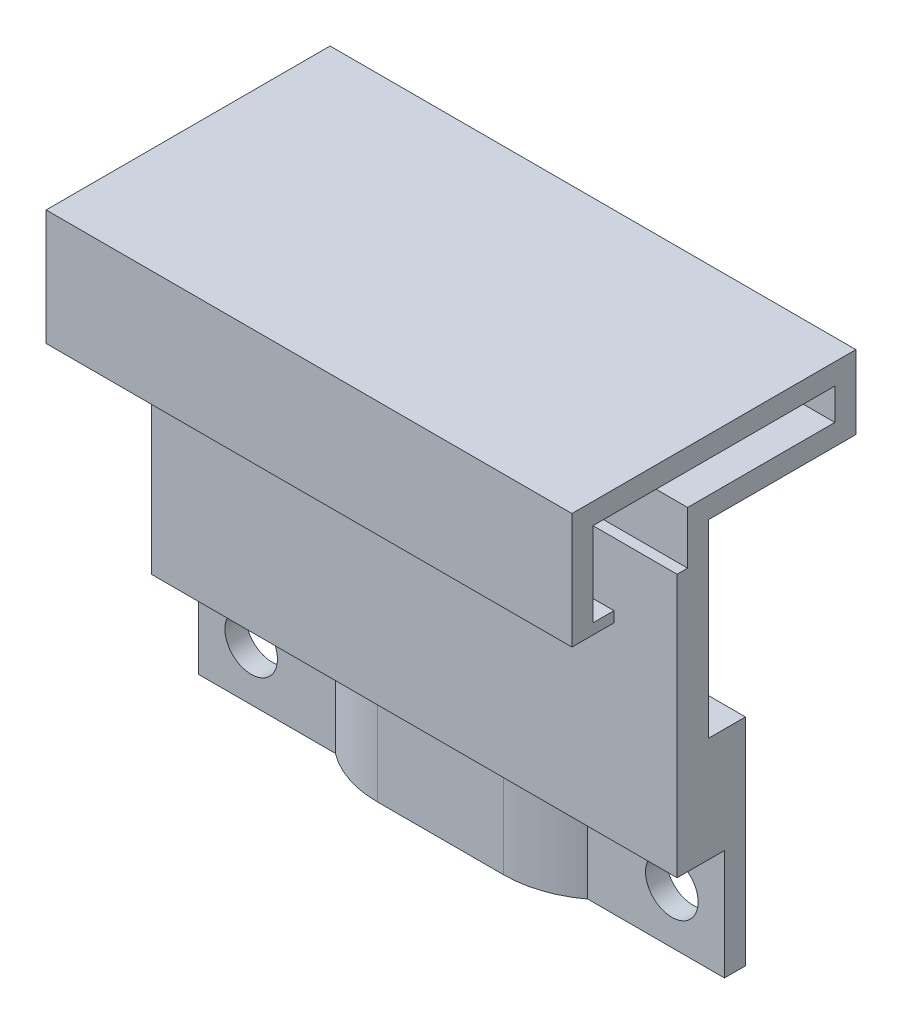
ISO-10303-21;
HEADER;
FILE_DESCRIPTION(('STEP AP214'),'2;1');
FILE_NAME('part.step','',(''),(''),'','','');
FILE_SCHEMA(('AUTOMOTIVE_DESIGN { 1 0 10303 214 1 1 1 1 }'));
ENDSEC;
DATA;
#1=APPLICATION_CONTEXT('core data for automotive mechanical design processes');
#2=APPLICATION_PROTOCOL_DEFINITION('international standard','automotive_design',2000,#1);
#3=PRODUCT_CONTEXT('',#1,'mechanical');
#4=PRODUCT('Part','Part','',(#3));
#5=PRODUCT_RELATED_PRODUCT_CATEGORY('part','',(#4));
#6=PRODUCT_DEFINITION_FORMATION('','',#4);
#7=PRODUCT_DEFINITION_CONTEXT('part definition',#1,'design');
#8=PRODUCT_DEFINITION('design','',#6,#7);
#9=PRODUCT_DEFINITION_SHAPE('','',#8);
#10=(LENGTH_UNIT() NAMED_UNIT(*) SI_UNIT(.MILLI.,.METRE.));
#11=(NAMED_UNIT(*) PLANE_ANGLE_UNIT() SI_UNIT($,.RADIAN.));
#12=(NAMED_UNIT(*) SI_UNIT($,.STERADIAN.) SOLID_ANGLE_UNIT());
#13=UNCERTAINTY_MEASURE_WITH_UNIT(LENGTH_MEASURE(1.E-05),#10,'distance_accuracy_value','');
#14=(GEOMETRIC_REPRESENTATION_CONTEXT(3) GLOBAL_UNCERTAINTY_ASSIGNED_CONTEXT((#13)) GLOBAL_UNIT_ASSIGNED_CONTEXT((#10,
#11,#12)) REPRESENTATION_CONTEXT('',''));
#15=CARTESIAN_POINT('',(0.,0.,0.));
#16=DIRECTION('',(0.,0.,1.));
#17=DIRECTION('',(1.,0.,0.));
#18=AXIS2_PLACEMENT_3D('',#15,#16,#17);
#19=CARTESIAN_POINT('',(0.,-15.,0.));
#20=DIRECTION('',(0.,-1.,0.));
#21=DIRECTION('',(1.,0.,0.));
#22=AXIS2_PLACEMENT_3D('',#19,#20,#21);
#23=PLANE('',#22);
#24=DIRECTION('',(-1.,0.,0.));
#25=VECTOR('',#24,1.);
#26=CARTESIAN_POINT('',(-50.,-15.,-2.5));
#27=LINE('',#26,#25);
#28=CARTESIAN_POINT('',(-37.,-15.,-2.5));
#29=VERTEX_POINT('',#28);
#30=CARTESIAN_POINT('',(-50.,-15.,-2.5));
#31=VERTEX_POINT('',#30);
#32=EDGE_CURVE('E242',#29,#31,#27,.T.);
#33=ORIENTED_EDGE('',*,*,#32,.F.);
#34=CARTESIAN_POINT('',(-31.,-15.,-10.5));
#35=DIRECTION('',(0.,-1.,0.));
#36=DIRECTION('',(1.,0.,0.));
#37=AXIS2_PLACEMENT_3D('',#34,#35,#36);
#38=CIRCLE('',#37,10.);
#39=CARTESIAN_POINT('',(-31.,-15.,-0.5));
#40=VERTEX_POINT('',#39);
#41=EDGE_CURVE('E48',#29,#40,#38,.F.);
#42=ORIENTED_EDGE('',*,*,#41,.T.);
#43=DIRECTION('',(-1.,0.,0.));
#44=VECTOR('',#43,1.);
#45=CARTESIAN_POINT('',(-37.,-15.,-0.5));
#46=LINE('',#45,#44);
#47=CARTESIAN_POINT('',(-19.,-15.,-0.5));
#48=VERTEX_POINT('',#47);
#49=EDGE_CURVE('E514',#48,#40,#46,.T.);
#50=ORIENTED_EDGE('',*,*,#49,.F.);
#51=CARTESIAN_POINT('',(-19.,-15.,-10.5));
#52=DIRECTION('',(0.,-1.,0.));
#53=DIRECTION('',(1.,0.,0.));
#54=AXIS2_PLACEMENT_3D('',#51,#52,#53);
#55=CIRCLE('',#54,10.);
#56=CARTESIAN_POINT('',(-13.,-15.,-2.5));
#57=VERTEX_POINT('',#56);
#58=EDGE_CURVE('E11',#48,#57,#55,.F.);
#59=ORIENTED_EDGE('',*,*,#58,.T.);
#60=CARTESIAN_POINT('',(0.,-15.,-2.5));
#61=VERTEX_POINT('',#60);
#62=EDGE_CURVE('E212',#61,#57,#27,.T.);
#63=ORIENTED_EDGE('',*,*,#62,.F.);
#64=DIRECTION('',(0.,0.,1.));
#65=VECTOR('',#64,1.);
#66=CARTESIAN_POINT('',(0.,-15.,2.));
#67=LINE('',#66,#65);
#68=CARTESIAN_POINT('',(0.,-15.,2.));
#69=VERTEX_POINT('',#68);
#70=EDGE_CURVE('E445',#61,#69,#67,.T.);
#71=ORIENTED_EDGE('',*,*,#70,.T.);
#72=DIRECTION('',(-1.,0.,0.));
#73=VECTOR('',#72,1.);
#74=CARTESIAN_POINT('',(-50.,-15.,2.));
#75=LINE('',#74,#73);
#76=CARTESIAN_POINT('',(-50.,-15.,2.));
#77=VERTEX_POINT('',#76);
#78=EDGE_CURVE('E440',#69,#77,#75,.T.);
#79=ORIENTED_EDGE('',*,*,#78,.T.);
#80=DIRECTION('',(0.,0.,-1.));
#81=VECTOR('',#80,1.);
#82=CARTESIAN_POINT('',(-50.,-15.,2.));
#83=LINE('',#82,#81);
#84=EDGE_CURVE('E482',#77,#31,#83,.T.);
#85=ORIENTED_EDGE('',*,*,#84,.T.);
#86=EDGE_LOOP('',(#33,#42,#50,#59,#63,#71,#79,#85));
#87=FACE_BOUND('',#86,.T.);
#88=ADVANCED_FACE('F40',(#87),#23,.T.);
#89=CARTESIAN_POINT('',(-50.,-25.5,-2.5));
#90=DIRECTION('',(0.,0.,-1.));
#91=DIRECTION('',(-1.,0.,0.));
#92=AXIS2_PLACEMENT_3D('',#89,#90,#91);
#93=PLANE('',#92);
#94=CARTESIAN_POINT('',(-45.,-20.5,-2.5));
#95=DIRECTION('',(0.,0.,-1.));
#96=DIRECTION('',(-1.,0.,0.));
#97=AXIS2_PLACEMENT_3D('',#94,#95,#96);
#98=CIRCLE('',#97,2.5);
#99=CARTESIAN_POINT('',(-47.5,-20.5,-2.5));
#100=VERTEX_POINT('',#99);
#101=EDGE_CURVE('E243',#100,#100,#98,.T.);
#102=ORIENTED_EDGE('',*,*,#101,.T.);
#103=EDGE_LOOP('',(#102));
#104=FACE_BOUND('',#103,.T.);
#105=DIRECTION('',(0.,-1.,0.));
#106=VECTOR('',#105,1.);
#107=CARTESIAN_POINT('',(-37.,-25.5,-2.5));
#108=LINE('',#107,#106);
#109=CARTESIAN_POINT('',(-37.,-25.5,-2.5));
#110=VERTEX_POINT('',#109);
#111=EDGE_CURVE('E215',#29,#110,#108,.T.);
#112=ORIENTED_EDGE('',*,*,#111,.F.);
#113=ORIENTED_EDGE('',*,*,#32,.T.);
#114=DIRECTION('',(0.,1.,0.));
#115=VECTOR('',#114,1.);
#116=CARTESIAN_POINT('',(-50.,-25.5,-2.5));
#117=LINE('',#116,#115);
#118=CARTESIAN_POINT('',(-50.,-25.5,-2.5));
#119=VERTEX_POINT('',#118);
#120=EDGE_CURVE('E226',#119,#31,#117,.T.);
#121=ORIENTED_EDGE('',*,*,#120,.F.);
#122=DIRECTION('',(-1.,0.,0.));
#123=VECTOR('',#122,1.);
#124=CARTESIAN_POINT('',(-50.,-25.5,-2.5));
#125=LINE('',#124,#123);
#126=EDGE_CURVE('E227',#110,#119,#125,.T.);
#127=ORIENTED_EDGE('',*,*,#126,.F.);
#128=EDGE_LOOP('',(#112,#113,#121,#127));
#129=FACE_BOUND('',#128,.T.);
#130=ADVANCED_FACE('F312',(#104,#129),#93,.F.);
#131=CARTESIAN_POINT('',(-5.,-20.5,-2.5));
#132=DIRECTION('',(0.,0.,-1.));
#133=DIRECTION('',(-1.,0.,0.));
#134=AXIS2_PLACEMENT_3D('',#131,#132,#133);
#135=CIRCLE('',#134,2.5);
#136=CARTESIAN_POINT('',(-7.5,-20.5,-2.5));
#137=VERTEX_POINT('',#136);
#138=EDGE_CURVE('E239',#137,#137,#135,.T.);
#139=ORIENTED_EDGE('',*,*,#138,.T.);
#140=EDGE_LOOP('',(#139));
#141=FACE_BOUND('',#140,.T.);
#142=DIRECTION('',(0.,1.,0.));
#143=VECTOR('',#142,1.);
#144=CARTESIAN_POINT('',(-13.,-25.5,-2.5));
#145=LINE('',#144,#143);
#146=CARTESIAN_POINT('',(-13.,-25.5,-2.5));
#147=VERTEX_POINT('',#146);
#148=EDGE_CURVE('E207',#147,#57,#145,.T.);
#149=ORIENTED_EDGE('',*,*,#148,.F.);
#150=CARTESIAN_POINT('',(0.,-25.5,-2.5));
#151=VERTEX_POINT('',#150);
#152=EDGE_CURVE('E211',#151,#147,#125,.T.);
#153=ORIENTED_EDGE('',*,*,#152,.F.);
#154=DIRECTION('',(0.,1.,0.));
#155=VECTOR('',#154,1.);
#156=CARTESIAN_POINT('',(0.,-25.5,-2.5));
#157=LINE('',#156,#155);
#158=EDGE_CURVE('E496',#151,#61,#157,.T.);
#159=ORIENTED_EDGE('',*,*,#158,.T.);
#160=ORIENTED_EDGE('',*,*,#62,.T.);
#161=EDGE_LOOP('',(#149,#153,#159,#160));
#162=FACE_BOUND('',#161,.T.);
#163=ADVANCED_FACE('F209',(#141,#162),#93,.F.);
#164=CARTESIAN_POINT('',(0.,0.,-1.));
#165=DIRECTION('',(0.,0.,-1.));
#166=DIRECTION('',(-1.,0.,0.));
#167=AXIS2_PLACEMENT_3D('',#164,#165,#166);
#168=PLANE('',#167);
#169=DIRECTION('',(0.,-1.,0.));
#170=VECTOR('',#169,1.);
#171=CARTESIAN_POINT('',(0.,13.,-1.));
#172=LINE('',#171,#170);
#173=CARTESIAN_POINT('',(0.,13.,-1.));
#174=VERTEX_POINT('',#173);
#175=CARTESIAN_POINT('',(0.,-5.00000000000001,-1.));
#176=VERTEX_POINT('',#175);
#177=EDGE_CURVE('E392',#174,#176,#172,.T.);
#178=ORIENTED_EDGE('',*,*,#177,.T.);
#179=DIRECTION('',(1.,0.,0.));
#180=VECTOR('',#179,1.);
#181=CARTESIAN_POINT('',(-50.,-5.00000000000001,-1.));
#182=LINE('',#181,#180);
#183=CARTESIAN_POINT('',(-50.,-5.00000000000001,-1.));
#184=VERTEX_POINT('',#183);
#185=EDGE_CURVE('E493',#184,#176,#182,.T.);
#186=ORIENTED_EDGE('',*,*,#185,.F.);
#187=DIRECTION('',(0.,-1.,0.));
#188=VECTOR('',#187,1.);
#189=CARTESIAN_POINT('',(-50.,0.,-1.));
#190=LINE('',#189,#188);
#191=CARTESIAN_POINT('',(-50.,13.,-0.999999999999999));
#192=VERTEX_POINT('',#191);
#193=EDGE_CURVE('E469',#192,#184,#190,.T.);
#194=ORIENTED_EDGE('',*,*,#193,.F.);
#195=DIRECTION('',(1.,0.,0.));
#196=VECTOR('',#195,1.);
#197=CARTESIAN_POINT('',(0.,13.,-1.));
#198=LINE('',#197,#196);
#199=EDGE_CURVE('E395',#192,#174,#198,.T.);
#200=ORIENTED_EDGE('',*,*,#199,.T.);
#201=EDGE_LOOP('',(#178,#186,#194,#200));
#202=FACE_BOUND('',#201,.T.);
#203=ADVANCED_FACE('F536',(#202),#168,.T.);
#204=CARTESIAN_POINT('',(-10.,9.,10.));
#205=DIRECTION('',(0.,0.,1.));
#206=DIRECTION('',(1.,0.,0.));
#207=AXIS2_PLACEMENT_3D('',#204,#205,#206);
#208=PLANE('',#207);
#209=DIRECTION('',(1.,0.,0.));
#210=VECTOR('',#209,1.);
#211=CARTESIAN_POINT('',(0.,10.,10.));
#212=LINE('',#211,#210);
#213=CARTESIAN_POINT('',(-50.,10.,10.));
#214=VERTEX_POINT('',#213);
#215=CARTESIAN_POINT('',(0.,10.,10.));
#216=VERTEX_POINT('',#215);
#217=EDGE_CURVE('E347',#214,#216,#212,.T.);
#218=ORIENTED_EDGE('',*,*,#217,.F.);
#219=DIRECTION('',(0.,-1.,0.));
#220=VECTOR('',#219,1.);
#221=CARTESIAN_POINT('',(-50.,0.,10.));
#222=LINE('',#221,#220);
#223=CARTESIAN_POINT('',(-50.,18.,10.));
#224=VERTEX_POINT('',#223);
#225=EDGE_CURVE('E439',#224,#214,#222,.T.);
#226=ORIENTED_EDGE('',*,*,#225,.F.);
#227=DIRECTION('',(1.,0.,0.));
#228=VECTOR('',#227,1.);
#229=CARTESIAN_POINT('',(-10.,18.,10.));
#230=LINE('',#229,#228);
#231=CARTESIAN_POINT('',(0.,18.,10.));
#232=VERTEX_POINT('',#231);
#233=EDGE_CURVE('E385',#224,#232,#230,.T.);
#234=ORIENTED_EDGE('',*,*,#233,.T.);
#235=DIRECTION('',(0.,1.,0.));
#236=VECTOR('',#235,1.);
#237=CARTESIAN_POINT('',(0.,9.,10.));
#238=LINE('',#237,#236);
#239=EDGE_CURVE('E260',#216,#232,#238,.T.);
#240=ORIENTED_EDGE('',*,*,#239,.F.);
#241=EDGE_LOOP('',(#218,#226,#234,#240));
#242=FACE_BOUND('',#241,.T.);
#243=ADVANCED_FACE('F565',(#242),#208,.F.);
#244=CARTESIAN_POINT('',(-10.,18.,11.));
#245=DIRECTION('',(0.,1.,0.));
#246=DIRECTION('',(0.,0.,1.));
#247=AXIS2_PLACEMENT_3D('',#244,#245,#246);
#248=PLANE('',#247);
#249=ORIENTED_EDGE('',*,*,#233,.F.);
#250=DIRECTION('',(0.,0.,1.));
#251=VECTOR('',#250,1.);
#252=CARTESIAN_POINT('',(-50.,18.,0.));
#253=LINE('',#252,#251);
#254=CARTESIAN_POINT('',(-50.,18.,-13.0045555328309));
#255=VERTEX_POINT('',#254);
#256=EDGE_CURVE('E436',#255,#224,#253,.T.);
#257=ORIENTED_EDGE('',*,*,#256,.F.);
#258=DIRECTION('',(1.,0.,0.));
#259=VECTOR('',#258,1.);
#260=CARTESIAN_POINT('',(-50.,18.,-13.0045555328309));
#261=LINE('',#260,#259);
#262=CARTESIAN_POINT('',(-10.,18.,-13.0022777664154));
#263=VERTEX_POINT('',#262);
#264=EDGE_CURVE('E348',#255,#263,#261,.T.);
#265=ORIENTED_EDGE('',*,*,#264,.T.);
#266=DIRECTION('',(1.,0.,0.));
#267=VECTOR('',#266,1.);
#268=CARTESIAN_POINT('',(-10.,18.,-13.));
#269=LINE('',#268,#267);
#270=CARTESIAN_POINT('',(0.,18.,-13.));
#271=VERTEX_POINT('',#270);
#272=EDGE_CURVE('E256',#263,#271,#269,.T.);
#273=ORIENTED_EDGE('',*,*,#272,.T.);
#274=DIRECTION('',(0.,0.,-1.));
#275=VECTOR('',#274,1.);
#276=CARTESIAN_POINT('',(0.,18.,11.));
#277=LINE('',#276,#275);
#278=EDGE_CURVE('E259',#232,#271,#277,.T.);
#279=ORIENTED_EDGE('',*,*,#278,.F.);
#280=EDGE_LOOP('',(#249,#257,#265,#273,#279));
#281=FACE_BOUND('',#280,.T.);
#282=ADVANCED_FACE('F278',(#281),#248,.F.);
#283=CARTESIAN_POINT('',(-10.,19.,-13.));
#284=DIRECTION('',(0.,0.,-1.));
#285=DIRECTION('',(-1.,0.,0.));
#286=AXIS2_PLACEMENT_3D('',#283,#284,#285);
#287=PLANE('',#286);
#288=ORIENTED_EDGE('',*,*,#272,.F.);
#289=CARTESIAN_POINT('',(-10.,18.,-13.));
#290=DIRECTION('',(0.,-1.,0.));
#291=VECTOR('',#290,1.);
#292=LINE('',#289,#291);
#293=CARTESIAN_POINT('',(-10.,15.,-13.0022777664154));
#294=VERTEX_POINT('',#293);
#295=EDGE_CURVE('E400',#263,#294,#292,.T.);
#296=ORIENTED_EDGE('',*,*,#295,.T.);
#297=DIRECTION('',(1.,0.,0.));
#298=VECTOR('',#297,1.);
#299=CARTESIAN_POINT('',(-10.,15.,-13.));
#300=LINE('',#299,#298);
#301=CARTESIAN_POINT('',(0.,15.,-13.));
#302=VERTEX_POINT('',#301);
#303=EDGE_CURVE('E249',#294,#302,#300,.T.);
#304=ORIENTED_EDGE('',*,*,#303,.T.);
#305=DIRECTION('',(0.,-1.,0.));
#306=VECTOR('',#305,1.);
#307=CARTESIAN_POINT('',(0.,19.,-13.));
#308=LINE('',#307,#306);
#309=EDGE_CURVE('E252',#271,#302,#308,.T.);
#310=ORIENTED_EDGE('',*,*,#309,.F.);
#311=EDGE_LOOP('',(#288,#296,#304,#310));
#312=FACE_BOUND('',#311,.T.);
#313=ADVANCED_FACE('F267',(#312),#287,.F.);
#314=CARTESIAN_POINT('',(0.,10.,2.));
#315=DIRECTION('',(0.,-1.,0.));
#316=DIRECTION('',(1.,0.,0.));
#317=AXIS2_PLACEMENT_3D('',#314,#315,#316);
#318=PLANE('',#317);
#319=DIRECTION('',(1.,0.,0.));
#320=VECTOR('',#319,1.);
#321=CARTESIAN_POINT('',(-10.,10.,0.999999999999999));
#322=LINE('',#321,#320);
#323=CARTESIAN_POINT('',(-50.,10.,0.999999999999999));
#324=VERTEX_POINT('',#323);
#325=CARTESIAN_POINT('',(0.,10.,0.999999999999999));
#326=VERTEX_POINT('',#325);
#327=EDGE_CURVE('E404',#324,#326,#322,.T.);
#328=ORIENTED_EDGE('',*,*,#327,.F.);
#329=DIRECTION('',(0.,0.,-1.));
#330=VECTOR('',#329,1.);
#331=CARTESIAN_POINT('',(-50.,10.,0.));
#332=LINE('',#331,#330);
#333=CARTESIAN_POINT('',(-50.,10.,2.));
#334=VERTEX_POINT('',#333);
#335=EDGE_CURVE('E475',#334,#324,#332,.T.);
#336=ORIENTED_EDGE('',*,*,#335,.F.);
#337=DIRECTION('',(-1.,0.,0.));
#338=VECTOR('',#337,1.);
#339=CARTESIAN_POINT('',(0.,10.,2.));
#340=LINE('',#339,#338);
#341=CARTESIAN_POINT('',(0.,10.,2.));
#342=VERTEX_POINT('',#341);
#343=EDGE_CURVE('E415',#342,#334,#340,.T.);
#344=ORIENTED_EDGE('',*,*,#343,.F.);
#345=DIRECTION('',(0.,0.,-1.));
#346=VECTOR('',#345,1.);
#347=CARTESIAN_POINT('',(0.,10.,2.));
#348=LINE('',#347,#346);
#349=EDGE_CURVE('E238',#342,#326,#348,.T.);
#350=ORIENTED_EDGE('',*,*,#349,.T.);
#351=EDGE_LOOP('',(#328,#336,#344,#350));
#352=FACE_BOUND('',#351,.T.);
#353=ADVANCED_FACE('F277',(#352),#318,.F.);
#354=CARTESIAN_POINT('',(0.,0.,2.));
#355=DIRECTION('',(-1.,0.,0.));
#356=DIRECTION('',(0.,-1.,0.));
#357=AXIS2_PLACEMENT_3D('',#354,#355,#356);
#358=PLANE('',#357);
#359=DIRECTION('',(0.,1.,0.));
#360=VECTOR('',#359,1.);
#361=CARTESIAN_POINT('',(0.,0.,2.));
#362=LINE('',#361,#360);
#363=EDGE_CURVE('E412',#69,#342,#362,.T.);
#364=ORIENTED_EDGE('',*,*,#363,.F.);
#365=ORIENTED_EDGE('',*,*,#70,.F.);
#366=ORIENTED_EDGE('',*,*,#158,.F.);
#367=DIRECTION('',(0.,0.,1.));
#368=VECTOR('',#367,1.);
#369=CARTESIAN_POINT('',(0.,-25.5,-4.5));
#370=LINE('',#369,#368);
#371=CARTESIAN_POINT('',(0.,-25.5,-4.5));
#372=VERTEX_POINT('',#371);
#373=EDGE_CURVE('E224',#372,#151,#370,.T.);
#374=ORIENTED_EDGE('',*,*,#373,.F.);
#375=DIRECTION('',(0.,-1.,0.));
#376=VECTOR('',#375,1.);
#377=CARTESIAN_POINT('',(0.,-15.,-4.5));
#378=LINE('',#377,#376);
#379=CARTESIAN_POINT('',(0.,-5.00000000000001,-4.5));
#380=VERTEX_POINT('',#379);
#381=EDGE_CURVE('E492',#380,#372,#378,.T.);
#382=ORIENTED_EDGE('',*,*,#381,.F.);
#383=DIRECTION('',(0.,0.,1.));
#384=VECTOR('',#383,1.);
#385=CARTESIAN_POINT('',(0.,-5.00000000000001,-4.5));
#386=LINE('',#385,#384);
#387=EDGE_CURVE('E489',#380,#176,#386,.T.);
#388=ORIENTED_EDGE('',*,*,#387,.T.);
#389=ORIENTED_EDGE('',*,*,#177,.F.);
#390=DIRECTION('',(0.,0.,1.));
#391=VECTOR('',#390,1.);
#392=CARTESIAN_POINT('',(0.,13.,-14.));
#393=LINE('',#392,#391);
#394=CARTESIAN_POINT('',(0.,13.,-15.));
#395=VERTEX_POINT('',#394);
#396=EDGE_CURVE('E253',#395,#174,#393,.T.);
#397=ORIENTED_EDGE('',*,*,#396,.F.);
#398=DIRECTION('',(0.,-1.,0.));
#399=VECTOR('',#398,1.);
#400=CARTESIAN_POINT('',(0.,13.,-15.));
#401=LINE('',#400,#399);
#402=CARTESIAN_POINT('',(0.,20.,-15.));
#403=VERTEX_POINT('',#402);
#404=EDGE_CURVE('E375',#403,#395,#401,.T.);
#405=ORIENTED_EDGE('',*,*,#404,.F.);
#406=DIRECTION('',(0.,0.,-1.));
#407=VECTOR('',#406,1.);
#408=CARTESIAN_POINT('',(0.,20.,-14.));
#409=LINE('',#408,#407);
#410=CARTESIAN_POINT('',(0.,20.,12.));
#411=VERTEX_POINT('',#410);
#412=EDGE_CURVE('E383',#411,#403,#409,.T.);
#413=ORIENTED_EDGE('',*,*,#412,.F.);
#414=DIRECTION('',(0.,1.,0.));
#415=VECTOR('',#414,1.);
#416=CARTESIAN_POINT('',(0.,20.,12.));
#417=LINE('',#416,#415);
#418=CARTESIAN_POINT('',(0.,9.,12.));
#419=VERTEX_POINT('',#418);
#420=EDGE_CURVE('E370',#419,#411,#417,.T.);
#421=ORIENTED_EDGE('',*,*,#420,.F.);
#422=DIRECTION('',(0.,0.,1.));
#423=VECTOR('',#422,1.);
#424=CARTESIAN_POINT('',(0.,9.,11.));
#425=LINE('',#424,#423);
#426=CARTESIAN_POINT('',(0.,9.,8.));
#427=VERTEX_POINT('',#426);
#428=EDGE_CURVE('E386',#427,#419,#425,.T.);
#429=ORIENTED_EDGE('',*,*,#428,.F.);
#430=DIRECTION('',(0.,-1.,0.));
#431=VECTOR('',#430,1.);
#432=CARTESIAN_POINT('',(0.,9.,8.));
#433=LINE('',#432,#431);
#434=CARTESIAN_POINT('',(0.,10.,8.));
#435=VERTEX_POINT('',#434);
#436=EDGE_CURVE('E356',#435,#427,#433,.T.);
#437=ORIENTED_EDGE('',*,*,#436,.F.);
#438=DIRECTION('',(0.,0.,1.));
#439=VECTOR('',#438,1.);
#440=CARTESIAN_POINT('',(0.,10.,8.));
#441=LINE('',#440,#439);
#442=EDGE_CURVE('E363',#435,#216,#441,.T.);
#443=ORIENTED_EDGE('',*,*,#442,.T.);
#444=ORIENTED_EDGE('',*,*,#239,.T.);
#445=ORIENTED_EDGE('',*,*,#278,.T.);
#446=ORIENTED_EDGE('',*,*,#309,.T.);
#447=DIRECTION('',(0.,0.,-1.));
#448=VECTOR('',#447,1.);
#449=CARTESIAN_POINT('',(0.,15.,0.));
#450=LINE('',#449,#448);
#451=CARTESIAN_POINT('',(0.,15.,0.999999999999999));
#452=VERTEX_POINT('',#451);
#453=EDGE_CURVE('E403',#452,#302,#450,.T.);
#454=ORIENTED_EDGE('',*,*,#453,.F.);
#455=DIRECTION('',(0.,-1.,0.));
#456=VECTOR('',#455,1.);
#457=CARTESIAN_POINT('',(0.,15.,0.999999999999999));
#458=LINE('',#457,#456);
#459=EDGE_CURVE('E407',#452,#326,#458,.T.);
#460=ORIENTED_EDGE('',*,*,#459,.T.);
#461=ORIENTED_EDGE('',*,*,#349,.F.);
#462=EDGE_LOOP('',(#364,#365,#366,#374,#382,#388,#389,#397,#405,#413,#421,#429,#437,#443,#444,
#445,#446,#454,#460,#461));
#463=FACE_BOUND('',#462,.T.);
#464=ADVANCED_FACE('F293',(#463),#358,.F.);
#465=CARTESIAN_POINT('',(0.,0.,2.));
#466=DIRECTION('',(0.,0.,1.));
#467=DIRECTION('',(1.,0.,0.));
#468=AXIS2_PLACEMENT_3D('',#465,#466,#467);
#469=PLANE('',#468);
#470=ORIENTED_EDGE('',*,*,#363,.T.);
#471=ORIENTED_EDGE('',*,*,#343,.T.);
#472=DIRECTION('',(0.,1.,0.));
#473=VECTOR('',#472,1.);
#474=CARTESIAN_POINT('',(-50.,0.,2.));
#475=LINE('',#474,#473);
#476=EDGE_CURVE('E472',#77,#334,#475,.T.);
#477=ORIENTED_EDGE('',*,*,#476,.F.);
#478=ORIENTED_EDGE('',*,*,#78,.F.);
#479=EDGE_LOOP('',(#470,#471,#477,#478));
#480=FACE_BOUND('',#479,.T.);
#481=ADVANCED_FACE('F289',(#480),#469,.T.);
#482=CARTESIAN_POINT('',(-10.,15.,0.999999999999999));
#483=DIRECTION('',(0.,0.,-1.));
#484=DIRECTION('',(-1.,0.,0.));
#485=AXIS2_PLACEMENT_3D('',#482,#483,#484);
#486=PLANE('',#485);
#487=ORIENTED_EDGE('',*,*,#327,.T.);
#488=ORIENTED_EDGE('',*,*,#459,.F.);
#489=DIRECTION('',(1.,0.,0.));
#490=VECTOR('',#489,1.);
#491=CARTESIAN_POINT('',(-10.,15.,0.999999999999999));
#492=LINE('',#491,#490);
#493=CARTESIAN_POINT('',(-50.,15.,0.999999999999999));
#494=VERTEX_POINT('',#493);
#495=EDGE_CURVE('E401',#494,#452,#492,.T.);
#496=ORIENTED_EDGE('',*,*,#495,.F.);
#497=DIRECTION('',(0.,1.,0.));
#498=VECTOR('',#497,1.);
#499=CARTESIAN_POINT('',(-50.,0.,0.999999999999999));
#500=LINE('',#499,#498);
#501=EDGE_CURVE('E424',#324,#494,#500,.T.);
#502=ORIENTED_EDGE('',*,*,#501,.F.);
#503=EDGE_LOOP('',(#487,#488,#496,#502));
#504=FACE_BOUND('',#503,.T.);
#505=ADVANCED_FACE('F285',(#504),#486,.F.);
#506=CARTESIAN_POINT('',(0.,15.,0.));
#507=DIRECTION('',(0.,1.,0.));
#508=DIRECTION('',(-1.,0.,0.));
#509=AXIS2_PLACEMENT_3D('',#506,#507,#508);
#510=PLANE('',#509);
#511=ORIENTED_EDGE('',*,*,#303,.F.);
#512=DIRECTION('',(1.,0.,0.));
#513=VECTOR('',#512,1.);
#514=CARTESIAN_POINT('',(-50.,15.,-13.0045555328309));
#515=LINE('',#514,#513);
#516=CARTESIAN_POINT('',(-50.,15.,-13.0045555328309));
#517=VERTEX_POINT('',#516);
#518=EDGE_CURVE('E340',#517,#294,#515,.T.);
#519=ORIENTED_EDGE('',*,*,#518,.F.);
#520=DIRECTION('',(0.,0.,-1.));
#521=VECTOR('',#520,1.);
#522=CARTESIAN_POINT('',(-50.,15.,0.));
#523=LINE('',#522,#521);
#524=EDGE_CURVE('E478',#494,#517,#523,.T.);
#525=ORIENTED_EDGE('',*,*,#524,.F.);
#526=ORIENTED_EDGE('',*,*,#495,.T.);
#527=ORIENTED_EDGE('',*,*,#453,.T.);
#528=EDGE_LOOP('',(#511,#519,#525,#526,#527));
#529=FACE_BOUND('',#528,.T.);
#530=ADVANCED_FACE('F282',(#529),#510,.T.);
#531=CARTESIAN_POINT('',(0.,13.,0.));
#532=DIRECTION('',(0.,-1.,0.));
#533=DIRECTION('',(0.,0.,-1.));
#534=AXIS2_PLACEMENT_3D('',#531,#532,#533);
#535=PLANE('',#534);
#536=ORIENTED_EDGE('',*,*,#199,.F.);
#537=DIRECTION('',(0.,0.,1.));
#538=VECTOR('',#537,1.);
#539=CARTESIAN_POINT('',(-50.,13.,0.));
#540=LINE('',#539,#538);
#541=CARTESIAN_POINT('',(-50.,13.,-15.));
#542=VERTEX_POINT('',#541);
#543=EDGE_CURVE('E466',#542,#192,#540,.T.);
#544=ORIENTED_EDGE('',*,*,#543,.F.);
#545=DIRECTION('',(-1.,0.,0.));
#546=VECTOR('',#545,1.);
#547=CARTESIAN_POINT('',(0.,13.,-15.));
#548=LINE('',#547,#546);
#549=EDGE_CURVE('E378',#395,#542,#548,.T.);
#550=ORIENTED_EDGE('',*,*,#549,.F.);
#551=ORIENTED_EDGE('',*,*,#396,.T.);
#552=EDGE_LOOP('',(#536,#544,#550,#551));
#553=FACE_BOUND('',#552,.T.);
#554=ADVANCED_FACE('F280',(#553),#535,.T.);
#555=CARTESIAN_POINT('',(0.,9.,0.));
#556=DIRECTION('',(0.,-1.,0.));
#557=DIRECTION('',(0.,0.,-1.));
#558=AXIS2_PLACEMENT_3D('',#555,#556,#557);
#559=PLANE('',#558);
#560=DIRECTION('',(1.,0.,0.));
#561=VECTOR('',#560,1.);
#562=CARTESIAN_POINT('',(-10.,9.,12.));
#563=LINE('',#562,#561);
#564=CARTESIAN_POINT('',(-50.,9.,12.));
#565=VERTEX_POINT('',#564);
#566=EDGE_CURVE('E367',#565,#419,#563,.T.);
#567=ORIENTED_EDGE('',*,*,#566,.F.);
#568=DIRECTION('',(0.,0.,1.));
#569=VECTOR('',#568,1.);
#570=CARTESIAN_POINT('',(-50.,9.,0.));
#571=LINE('',#570,#569);
#572=CARTESIAN_POINT('',(-50.,9.,8.));
#573=VERTEX_POINT('',#572);
#574=EDGE_CURVE('E454',#573,#565,#571,.T.);
#575=ORIENTED_EDGE('',*,*,#574,.F.);
#576=DIRECTION('',(-1.,0.,0.));
#577=VECTOR('',#576,1.);
#578=CARTESIAN_POINT('',(0.,9.,8.));
#579=LINE('',#578,#577);
#580=EDGE_CURVE('E359',#427,#573,#579,.T.);
#581=ORIENTED_EDGE('',*,*,#580,.F.);
#582=ORIENTED_EDGE('',*,*,#428,.T.);
#583=EDGE_LOOP('',(#567,#575,#581,#582));
#584=FACE_BOUND('',#583,.T.);
#585=ADVANCED_FACE('F556',(#584),#559,.T.);
#586=CARTESIAN_POINT('',(0.,20.,0.));
#587=DIRECTION('',(0.,1.,0.));
#588=DIRECTION('',(-1.,0.,0.));
#589=AXIS2_PLACEMENT_3D('',#586,#587,#588);
#590=PLANE('',#589);
#591=DIRECTION('',(1.,0.,0.));
#592=VECTOR('',#591,1.);
#593=CARTESIAN_POINT('',(0.,20.,-15.));
#594=LINE('',#593,#592);
#595=CARTESIAN_POINT('',(-50.,20.,-15.));
#596=VERTEX_POINT('',#595);
#597=EDGE_CURVE('E380',#596,#403,#594,.T.);
#598=ORIENTED_EDGE('',*,*,#597,.F.);
#599=DIRECTION('',(0.,0.,-1.));
#600=VECTOR('',#599,1.);
#601=CARTESIAN_POINT('',(-50.,20.,0.));
#602=LINE('',#601,#600);
#603=CARTESIAN_POINT('',(-50.,20.,12.));
#604=VERTEX_POINT('',#603);
#605=EDGE_CURVE('E460',#604,#596,#602,.T.);
#606=ORIENTED_EDGE('',*,*,#605,.F.);
#607=DIRECTION('',(-1.,0.,0.));
#608=VECTOR('',#607,1.);
#609=CARTESIAN_POINT('',(-10.,20.,12.));
#610=LINE('',#609,#608);
#611=EDGE_CURVE('E373',#411,#604,#610,.T.);
#612=ORIENTED_EDGE('',*,*,#611,.F.);
#613=ORIENTED_EDGE('',*,*,#412,.T.);
#614=EDGE_LOOP('',(#598,#606,#612,#613));
#615=FACE_BOUND('',#614,.T.);
#616=ADVANCED_FACE('F547',(#615),#590,.T.);
#617=CARTESIAN_POINT('',(0.,0.,-15.));
#618=DIRECTION('',(0.,0.,1.));
#619=DIRECTION('',(1.,0.,0.));
#620=AXIS2_PLACEMENT_3D('',#617,#618,#619);
#621=PLANE('',#620);
#622=ORIENTED_EDGE('',*,*,#404,.T.);
#623=ORIENTED_EDGE('',*,*,#549,.T.);
#624=DIRECTION('',(0.,-1.,0.));
#625=VECTOR('',#624,1.);
#626=CARTESIAN_POINT('',(-50.,0.,-15.));
#627=LINE('',#626,#625);
#628=EDGE_CURVE('E463',#596,#542,#627,.T.);
#629=ORIENTED_EDGE('',*,*,#628,.F.);
#630=ORIENTED_EDGE('',*,*,#597,.T.);
#631=EDGE_LOOP('',(#622,#623,#629,#630));
#632=FACE_BOUND('',#631,.T.);
#633=ADVANCED_FACE('F544',(#632),#621,.F.);
#634=CARTESIAN_POINT('',(0.,0.,12.));
#635=DIRECTION('',(0.,0.,1.));
#636=DIRECTION('',(1.,0.,0.));
#637=AXIS2_PLACEMENT_3D('',#634,#635,#636);
#638=PLANE('',#637);
#639=ORIENTED_EDGE('',*,*,#611,.T.);
#640=DIRECTION('',(0.,1.,0.));
#641=VECTOR('',#640,1.);
#642=CARTESIAN_POINT('',(-50.,0.,12.));
#643=LINE('',#642,#641);
#644=EDGE_CURVE('E457',#565,#604,#643,.T.);
#645=ORIENTED_EDGE('',*,*,#644,.F.);
#646=ORIENTED_EDGE('',*,*,#566,.T.);
#647=ORIENTED_EDGE('',*,*,#420,.T.);
#648=EDGE_LOOP('',(#639,#645,#646,#647));
#649=FACE_BOUND('',#648,.T.);
#650=ADVANCED_FACE('F552',(#649),#638,.T.);
#651=CARTESIAN_POINT('',(0.,10.,8.));
#652=DIRECTION('',(0.,-1.,0.));
#653=DIRECTION('',(0.,0.,-1.));
#654=AXIS2_PLACEMENT_3D('',#651,#652,#653);
#655=PLANE('',#654);
#656=ORIENTED_EDGE('',*,*,#217,.T.);
#657=ORIENTED_EDGE('',*,*,#442,.F.);
#658=DIRECTION('',(1.,0.,0.));
#659=VECTOR('',#658,1.);
#660=CARTESIAN_POINT('',(0.,10.,8.));
#661=LINE('',#660,#659);
#662=CARTESIAN_POINT('',(-50.,10.,8.));
#663=VERTEX_POINT('',#662);
#664=EDGE_CURVE('E361',#663,#435,#661,.T.);
#665=ORIENTED_EDGE('',*,*,#664,.F.);
#666=DIRECTION('',(0.,0.,-1.));
#667=VECTOR('',#666,1.);
#668=CARTESIAN_POINT('',(-50.,10.,0.));
#669=LINE('',#668,#667);
#670=EDGE_CURVE('E442',#214,#663,#669,.T.);
#671=ORIENTED_EDGE('',*,*,#670,.F.);
#672=EDGE_LOOP('',(#656,#657,#665,#671));
#673=FACE_BOUND('',#672,.T.);
#674=ADVANCED_FACE('F562',(#673),#655,.F.);
#675=CARTESIAN_POINT('',(0.,0.,8.));
#676=DIRECTION('',(0.,0.,1.));
#677=DIRECTION('',(1.,0.,0.));
#678=AXIS2_PLACEMENT_3D('',#675,#676,#677);
#679=PLANE('',#678);
#680=ORIENTED_EDGE('',*,*,#436,.T.);
#681=ORIENTED_EDGE('',*,*,#580,.T.);
#682=DIRECTION('',(0.,-1.,0.));
#683=VECTOR('',#682,1.);
#684=CARTESIAN_POINT('',(-50.,0.,8.));
#685=LINE('',#684,#683);
#686=EDGE_CURVE('E451',#663,#573,#685,.T.);
#687=ORIENTED_EDGE('',*,*,#686,.F.);
#688=ORIENTED_EDGE('',*,*,#664,.T.);
#689=EDGE_LOOP('',(#680,#681,#687,#688));
#690=FACE_BOUND('',#689,.T.);
#691=ADVANCED_FACE('F331',(#690),#679,.F.);
#692=CARTESIAN_POINT('',(-50.,0.,-13.0045555328309));
#693=DIRECTION('',(0.,0.,-1.));
#694=DIRECTION('',(-1.,0.,0.));
#695=AXIS2_PLACEMENT_3D('',#692,#693,#694);
#696=PLANE('',#695);
#697=ORIENTED_EDGE('',*,*,#295,.F.);
#698=ORIENTED_EDGE('',*,*,#264,.F.);
#699=DIRECTION('',(0.,1.,0.));
#700=VECTOR('',#699,1.);
#701=CARTESIAN_POINT('',(-50.,0.,-13.0045555328309));
#702=LINE('',#701,#700);
#703=EDGE_CURVE('E353',#517,#255,#702,.T.);
#704=ORIENTED_EDGE('',*,*,#703,.F.);
#705=ORIENTED_EDGE('',*,*,#518,.T.);
#706=EDGE_LOOP('',(#697,#698,#704,#705));
#707=FACE_BOUND('',#706,.T.);
#708=ADVANCED_FACE('F326',(#707),#696,.F.);
#709=CARTESIAN_POINT('',(-50.,0.,0.));
#710=DIRECTION('',(-1.,0.,0.));
#711=DIRECTION('',(0.,0.,1.));
#712=AXIS2_PLACEMENT_3D('',#709,#710,#711);
#713=PLANE('',#712);
#714=ORIENTED_EDGE('',*,*,#256,.T.);
#715=ORIENTED_EDGE('',*,*,#225,.T.);
#716=ORIENTED_EDGE('',*,*,#670,.T.);
#717=ORIENTED_EDGE('',*,*,#686,.T.);
#718=ORIENTED_EDGE('',*,*,#574,.T.);
#719=ORIENTED_EDGE('',*,*,#644,.T.);
#720=ORIENTED_EDGE('',*,*,#605,.T.);
#721=ORIENTED_EDGE('',*,*,#628,.T.);
#722=ORIENTED_EDGE('',*,*,#543,.T.);
#723=ORIENTED_EDGE('',*,*,#193,.T.);
#724=DIRECTION('',(0.,0.,1.));
#725=VECTOR('',#724,1.);
#726=CARTESIAN_POINT('',(-50.,-5.00000000000001,-4.5));
#727=LINE('',#726,#725);
#728=CARTESIAN_POINT('',(-50.,-5.00000000000001,-4.5));
#729=VERTEX_POINT('',#728);
#730=EDGE_CURVE('E485',#729,#184,#727,.T.);
#731=ORIENTED_EDGE('',*,*,#730,.F.);
#732=DIRECTION('',(0.,1.,0.));
#733=VECTOR('',#732,1.);
#734=CARTESIAN_POINT('',(-50.,-15.,-4.5));
#735=LINE('',#734,#733);
#736=CARTESIAN_POINT('',(-50.,-25.5,-4.5));
#737=VERTEX_POINT('',#736);
#738=EDGE_CURVE('E495',#737,#729,#735,.T.);
#739=ORIENTED_EDGE('',*,*,#738,.F.);
#740=DIRECTION('',(0.,0.,-1.));
#741=VECTOR('',#740,1.);
#742=CARTESIAN_POINT('',(-50.,-25.5,-4.5));
#743=LINE('',#742,#741);
#744=EDGE_CURVE('E504',#119,#737,#743,.T.);
#745=ORIENTED_EDGE('',*,*,#744,.F.);
#746=ORIENTED_EDGE('',*,*,#120,.T.);
#747=ORIENTED_EDGE('',*,*,#84,.F.);
#748=ORIENTED_EDGE('',*,*,#476,.T.);
#749=ORIENTED_EDGE('',*,*,#335,.T.);
#750=ORIENTED_EDGE('',*,*,#501,.T.);
#751=ORIENTED_EDGE('',*,*,#524,.T.);
#752=ORIENTED_EDGE('',*,*,#703,.T.);
#753=EDGE_LOOP('',(#714,#715,#716,#717,#718,#719,#720,#721,#722,#723,#731,#739,#745,#746,#747,
#748,#749,#750,#751,#752));
#754=FACE_BOUND('',#753,.T.);
#755=ADVANCED_FACE('F323',(#754),#713,.T.);
#756=CARTESIAN_POINT('',(-50.,-5.00000000000001,-4.5));
#757=DIRECTION('',(0.,-1.,0.));
#758=DIRECTION('',(1.,0.,0.));
#759=AXIS2_PLACEMENT_3D('',#756,#757,#758);
#760=PLANE('',#759);
#761=ORIENTED_EDGE('',*,*,#185,.T.);
#762=ORIENTED_EDGE('',*,*,#387,.F.);
#763=DIRECTION('',(1.,0.,0.));
#764=VECTOR('',#763,1.);
#765=CARTESIAN_POINT('',(-50.,-5.00000000000001,-4.5));
#766=LINE('',#765,#764);
#767=EDGE_CURVE('E498',#729,#380,#766,.T.);
#768=ORIENTED_EDGE('',*,*,#767,.F.);
#769=ORIENTED_EDGE('',*,*,#730,.T.);
#770=EDGE_LOOP('',(#761,#762,#768,#769));
#771=FACE_BOUND('',#770,.T.);
#772=ADVANCED_FACE('F321',(#771),#760,.F.);
#773=CARTESIAN_POINT('',(0.,0.,-4.5));
#774=DIRECTION('',(0.,0.,-1.));
#775=DIRECTION('',(-1.,0.,0.));
#776=AXIS2_PLACEMENT_3D('',#773,#774,#775);
#777=PLANE('',#776);
#778=CARTESIAN_POINT('',(-5.,-20.5,-4.5));
#779=DIRECTION('',(0.,0.,-1.));
#780=DIRECTION('',(-1.,0.,0.));
#781=AXIS2_PLACEMENT_3D('',#778,#779,#780);
#782=CIRCLE('',#781,2.5);
#783=CARTESIAN_POINT('',(-7.5,-20.5,-4.5));
#784=VERTEX_POINT('',#783);
#785=EDGE_CURVE('E246',#784,#784,#782,.T.);
#786=ORIENTED_EDGE('',*,*,#785,.F.);
#787=EDGE_LOOP('',(#786));
#788=FACE_BOUND('',#787,.T.);
#789=CARTESIAN_POINT('',(-45.,-20.5,-4.5));
#790=DIRECTION('',(0.,0.,-1.));
#791=DIRECTION('',(-1.,0.,0.));
#792=AXIS2_PLACEMENT_3D('',#789,#790,#791);
#793=CIRCLE('',#792,2.5);
#794=CARTESIAN_POINT('',(-47.5,-20.5,-4.5));
#795=VERTEX_POINT('',#794);
#796=EDGE_CURVE('E511',#795,#795,#793,.T.);
#797=ORIENTED_EDGE('',*,*,#796,.F.);
#798=EDGE_LOOP('',(#797));
#799=FACE_BOUND('',#798,.T.);
#800=ORIENTED_EDGE('',*,*,#738,.T.);
#801=ORIENTED_EDGE('',*,*,#767,.T.);
#802=ORIENTED_EDGE('',*,*,#381,.T.);
#803=DIRECTION('',(1.,0.,0.));
#804=VECTOR('',#803,1.);
#805=CARTESIAN_POINT('',(-50.,-25.5,-4.5));
#806=LINE('',#805,#804);
#807=EDGE_CURVE('E507',#737,#372,#806,.T.);
#808=ORIENTED_EDGE('',*,*,#807,.F.);
#809=EDGE_LOOP('',(#800,#801,#802,#808));
#810=FACE_BOUND('',#809,.T.);
#811=ADVANCED_FACE('F531',(#788,#799,#810),#777,.T.);
#812=CARTESIAN_POINT('',(0.,-25.5,0.));
#813=DIRECTION('',(0.,1.,0.));
#814=DIRECTION('',(-1.,0.,0.));
#815=AXIS2_PLACEMENT_3D('',#812,#813,#814);
#816=PLANE('',#815);
#817=DIRECTION('',(1.,0.,0.));
#818=VECTOR('',#817,1.);
#819=CARTESIAN_POINT('',(-37.,-25.5,-0.5));
#820=LINE('',#819,#818);
#821=CARTESIAN_POINT('',(-31.,-25.5,-0.5));
#822=VERTEX_POINT('',#821);
#823=CARTESIAN_POINT('',(-19.,-25.5,-0.5));
#824=VERTEX_POINT('',#823);
#825=EDGE_CURVE('E214',#822,#824,#820,.T.);
#826=ORIENTED_EDGE('',*,*,#825,.F.);
#827=CARTESIAN_POINT('',(-31.,-25.5,-10.5));
#828=DIRECTION('',(0.,1.,0.));
#829=DIRECTION('',(-1.,0.,0.));
#830=AXIS2_PLACEMENT_3D('',#827,#828,#829);
#831=CIRCLE('',#830,10.);
#832=EDGE_CURVE('E230',#822,#110,#831,.F.);
#833=ORIENTED_EDGE('',*,*,#832,.T.);
#834=ORIENTED_EDGE('',*,*,#126,.T.);
#835=ORIENTED_EDGE('',*,*,#744,.T.);
#836=ORIENTED_EDGE('',*,*,#807,.T.);
#837=ORIENTED_EDGE('',*,*,#373,.T.);
#838=ORIENTED_EDGE('',*,*,#152,.T.);
#839=CARTESIAN_POINT('',(-19.,-25.5,-10.5));
#840=DIRECTION('',(0.,1.,0.));
#841=DIRECTION('',(-1.,0.,0.));
#842=AXIS2_PLACEMENT_3D('',#839,#840,#841);
#843=CIRCLE('',#842,10.);
#844=EDGE_CURVE('E220',#147,#824,#843,.F.);
#845=ORIENTED_EDGE('',*,*,#844,.T.);
#846=EDGE_LOOP('',(#826,#833,#834,#835,#836,#837,#838,#845));
#847=FACE_BOUND('',#846,.T.);
#848=ADVANCED_FACE('F219',(#847),#816,.F.);
#849=CARTESIAN_POINT('',(-45.,-20.5,5.5));
#850=DIRECTION('',(0.,0.,-1.));
#851=DIRECTION('',(-1.,0.,0.));
#852=AXIS2_PLACEMENT_3D('',#849,#850,#851);
#853=CYLINDRICAL_SURFACE('',#852,2.5);
#854=ORIENTED_EDGE('',*,*,#796,.T.);
#855=EDGE_LOOP('',(#854));
#856=FACE_BOUND('',#855,.T.);
#857=ORIENTED_EDGE('',*,*,#101,.F.);
#858=EDGE_LOOP('',(#857));
#859=FACE_BOUND('',#858,.T.);
#860=ADVANCED_FACE('F616',(#856,#859),#853,.F.);
#861=CARTESIAN_POINT('',(-5.,-20.5,5.5));
#862=DIRECTION('',(0.,0.,-1.));
#863=DIRECTION('',(-1.,0.,0.));
#864=AXIS2_PLACEMENT_3D('',#861,#862,#863);
#865=CYLINDRICAL_SURFACE('',#864,2.5);
#866=ORIENTED_EDGE('',*,*,#785,.T.);
#867=EDGE_LOOP('',(#866));
#868=FACE_BOUND('',#867,.T.);
#869=ORIENTED_EDGE('',*,*,#138,.F.);
#870=EDGE_LOOP('',(#869));
#871=FACE_BOUND('',#870,.T.);
#872=ADVANCED_FACE('F308',(#868,#871),#865,.F.);
#873=CARTESIAN_POINT('',(0.,0.,-0.5));
#874=DIRECTION('',(0.,0.,-1.));
#875=DIRECTION('',(-1.,0.,0.));
#876=AXIS2_PLACEMENT_3D('',#873,#874,#875);
#877=PLANE('',#876);
#878=ORIENTED_EDGE('',*,*,#49,.T.);
#879=DIRECTION('',(0.,1.,0.));
#880=VECTOR('',#879,1.);
#881=CARTESIAN_POINT('',(-31.,0.,-0.5));
#882=LINE('',#881,#880);
#883=EDGE_CURVE('E231',#40,#822,#882,.F.);
#884=ORIENTED_EDGE('',*,*,#883,.T.);
#885=ORIENTED_EDGE('',*,*,#825,.T.);
#886=DIRECTION('',(0.,-1.,0.));
#887=VECTOR('',#886,1.);
#888=CARTESIAN_POINT('',(-19.,0.,-0.5));
#889=LINE('',#888,#887);
#890=EDGE_CURVE('E229',#824,#48,#889,.F.);
#891=ORIENTED_EDGE('',*,*,#890,.T.);
#892=EDGE_LOOP('',(#878,#884,#885,#891));
#893=FACE_BOUND('',#892,.T.);
#894=ADVANCED_FACE('F302',(#893),#877,.F.);
#895=CARTESIAN_POINT('',(-31.,-25.5,-10.5));
#896=DIRECTION('',(0.,1.,0.));
#897=DIRECTION('',(0.,0.,1.));
#898=AXIS2_PLACEMENT_3D('',#895,#896,#897);
#899=CYLINDRICAL_SURFACE('',#898,10.);
#900=ORIENTED_EDGE('',*,*,#41,.F.);
#901=ORIENTED_EDGE('',*,*,#111,.T.);
#902=ORIENTED_EDGE('',*,*,#832,.F.);
#903=ORIENTED_EDGE('',*,*,#883,.F.);
#904=EDGE_LOOP('',(#900,#901,#902,#903));
#905=FACE_BOUND('',#904,.T.);
#906=ADVANCED_FACE('F300',(#905),#899,.T.);
#907=CARTESIAN_POINT('',(-19.,-25.5,-10.5));
#908=DIRECTION('',(0.,-1.,0.));
#909=DIRECTION('',(0.,0.,-1.));
#910=AXIS2_PLACEMENT_3D('',#907,#908,#909);
#911=CYLINDRICAL_SURFACE('',#910,10.);
#912=ORIENTED_EDGE('',*,*,#844,.F.);
#913=ORIENTED_EDGE('',*,*,#148,.T.);
#914=ORIENTED_EDGE('',*,*,#58,.F.);
#915=ORIENTED_EDGE('',*,*,#890,.F.);
#916=EDGE_LOOP('',(#912,#913,#914,#915));
#917=FACE_BOUND('',#916,.T.);
#918=ADVANCED_FACE('F42',(#917),#911,.T.);
#919=CLOSED_SHELL('',(#88,#130,#163,#203,#243,#282,#313,#353,#464,#481,#505,#530,#554,#585,#616,
#633,#650,#674,#691,#708,#755,#772,#811,#848,#860,#872,#894,#906,#918));
#920=MANIFOLD_SOLID_BREP('B2',#919);
#921=ADVANCED_BREP_SHAPE_REPRESENTATION('',(#18,#920),#14);
#922=SHAPE_DEFINITION_REPRESENTATION(#9,#921);
ENDSEC;
END-ISO-10303-21;
